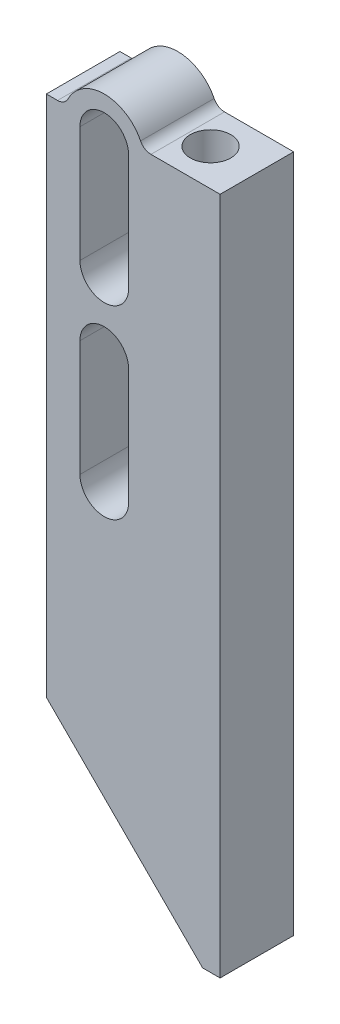
ISO-10303-21;
HEADER;
FILE_DESCRIPTION(('STEP AP214'),'2;1');
FILE_NAME('part.step','',(''),(''),'','','');
FILE_SCHEMA(('AUTOMOTIVE_DESIGN { 1 0 10303 214 1 1 1 1 }'));
ENDSEC;
DATA;
#1=APPLICATION_CONTEXT('core data for automotive mechanical design processes');
#2=APPLICATION_PROTOCOL_DEFINITION('international standard','automotive_design',2000,#1);
#3=PRODUCT_CONTEXT('',#1,'mechanical');
#4=PRODUCT('Part','Part','',(#3));
#5=PRODUCT_RELATED_PRODUCT_CATEGORY('part','',(#4));
#6=PRODUCT_DEFINITION_FORMATION('','',#4);
#7=PRODUCT_DEFINITION_CONTEXT('part definition',#1,'design');
#8=PRODUCT_DEFINITION('design','',#6,#7);
#9=PRODUCT_DEFINITION_SHAPE('','',#8);
#10=(LENGTH_UNIT() NAMED_UNIT(*) SI_UNIT(.MILLI.,.METRE.));
#11=(NAMED_UNIT(*) PLANE_ANGLE_UNIT() SI_UNIT($,.RADIAN.));
#12=(NAMED_UNIT(*) SI_UNIT($,.STERADIAN.) SOLID_ANGLE_UNIT());
#13=UNCERTAINTY_MEASURE_WITH_UNIT(LENGTH_MEASURE(1.E-05),#10,'distance_accuracy_value','');
#14=(GEOMETRIC_REPRESENTATION_CONTEXT(3) GLOBAL_UNCERTAINTY_ASSIGNED_CONTEXT((#13)) GLOBAL_UNIT_ASSIGNED_CONTEXT((#10,
#11,#12)) REPRESENTATION_CONTEXT('',''));
#15=CARTESIAN_POINT('',(0.,0.,0.));
#16=DIRECTION('',(0.,0.,1.));
#17=DIRECTION('',(1.,0.,0.));
#18=AXIS2_PLACEMENT_3D('',#15,#16,#17);
#19=CARTESIAN_POINT('',(137.825,40.4,-3.175));
#20=DIRECTION('',(0.,-1.,0.));
#21=DIRECTION('',(0.,0.,-1.));
#22=AXIS2_PLACEMENT_3D('',#19,#20,#21);
#23=PLANE('',#22);
#24=DIRECTION('',(0.,0.,1.));
#25=VECTOR('',#24,1.);
#26=CARTESIAN_POINT('',(137.825,40.4,-3.175));
#27=LINE('',#26,#25);
#28=CARTESIAN_POINT('',(137.825,40.4,-3.175));
#29=VERTEX_POINT('',#28);
#30=CARTESIAN_POINT('',(137.825,40.4,3.175));
#31=VERTEX_POINT('',#30);
#32=EDGE_CURVE('E265',#29,#31,#27,.T.);
#33=ORIENTED_EDGE('',*,*,#32,.T.);
#34=DIRECTION('',(1.,0.,0.));
#35=VECTOR('',#34,1.);
#36=CARTESIAN_POINT('',(137.825,40.4,3.175));
#37=LINE('',#36,#35);
#38=CARTESIAN_POINT('',(136.313708498985,40.4,3.175));
#39=VERTEX_POINT('',#38);
#40=EDGE_CURVE('E220',#39,#31,#37,.T.);
#41=ORIENTED_EDGE('',*,*,#40,.F.);
#42=DIRECTION('',(0.,0.,1.));
#43=VECTOR('',#42,1.);
#44=CARTESIAN_POINT('',(136.313708498985,40.4,-3.175));
#45=LINE('',#44,#43);
#46=CARTESIAN_POINT('',(136.313708498985,40.4,-3.175));
#47=VERTEX_POINT('',#46);
#48=EDGE_CURVE('E266',#47,#39,#45,.T.);
#49=ORIENTED_EDGE('',*,*,#48,.F.);
#50=DIRECTION('',(1.,0.,0.));
#51=VECTOR('',#50,1.);
#52=CARTESIAN_POINT('',(137.825,40.4,-3.175));
#53=LINE('',#52,#51);
#54=EDGE_CURVE('E245',#47,#29,#53,.T.);
#55=ORIENTED_EDGE('',*,*,#54,.T.);
#56=EDGE_LOOP('',(#33,#41,#49,#55));
#57=FACE_BOUND('',#56,.T.);
#58=ADVANCED_FACE('F31',(#57),#23,.T.);
#59=CARTESIAN_POINT('',(136.313708498985,40.4,-3.175));
#60=DIRECTION('',(-0.707106781186547,-0.707106781186548,0.));
#61=DIRECTION('',(0.707106781186548,-0.707106781186547,0.));
#62=AXIS2_PLACEMENT_3D('',#59,#60,#61);
#63=PLANE('',#62);
#64=ORIENTED_EDGE('',*,*,#48,.T.);
#65=DIRECTION('',(0.707106781186548,-0.707106781186547,0.));
#66=VECTOR('',#65,1.);
#67=CARTESIAN_POINT('',(136.313708498985,40.4,3.175));
#68=LINE('',#67,#66);
#69=CARTESIAN_POINT('',(122.825,53.888708498985,3.175));
#70=VERTEX_POINT('',#69);
#71=EDGE_CURVE('E242',#70,#39,#68,.T.);
#72=ORIENTED_EDGE('',*,*,#71,.F.);
#73=DIRECTION('',(0.,0.,1.));
#74=VECTOR('',#73,1.);
#75=CARTESIAN_POINT('',(122.825,53.888708498985,-3.175));
#76=LINE('',#75,#74);
#77=CARTESIAN_POINT('',(122.825,53.888708498985,-3.175));
#78=VERTEX_POINT('',#77);
#79=EDGE_CURVE('E269',#78,#70,#76,.T.);
#80=ORIENTED_EDGE('',*,*,#79,.F.);
#81=DIRECTION('',(0.707106781186548,-0.707106781186547,0.));
#82=VECTOR('',#81,1.);
#83=CARTESIAN_POINT('',(136.313708498985,40.4,-3.175));
#84=LINE('',#83,#82);
#85=EDGE_CURVE('E262',#78,#47,#84,.T.);
#86=ORIENTED_EDGE('',*,*,#85,.T.);
#87=EDGE_LOOP('',(#64,#72,#80,#86));
#88=FACE_BOUND('',#87,.T.);
#89=ADVANCED_FACE('F322',(#88),#63,.T.);
#90=CARTESIAN_POINT('',(122.825,53.888708498985,-3.175));
#91=DIRECTION('',(-1.,0.,0.));
#92=DIRECTION('',(0.,0.,1.));
#93=AXIS2_PLACEMENT_3D('',#90,#91,#92);
#94=PLANE('',#93);
#95=ORIENTED_EDGE('',*,*,#79,.T.);
#96=DIRECTION('',(0.,-1.,0.));
#97=VECTOR('',#96,1.);
#98=CARTESIAN_POINT('',(122.825,53.888708498985,3.175));
#99=LINE('',#98,#97);
#100=CARTESIAN_POINT('',(122.825,99.,3.175));
#101=VERTEX_POINT('',#100);
#102=EDGE_CURVE('E239',#101,#70,#99,.T.);
#103=ORIENTED_EDGE('',*,*,#102,.F.);
#104=DIRECTION('',(0.,0.,1.));
#105=VECTOR('',#104,1.);
#106=CARTESIAN_POINT('',(122.825,99.,-3.175));
#107=LINE('',#106,#105);
#108=CARTESIAN_POINT('',(122.825,99.,-3.175));
#109=VERTEX_POINT('',#108);
#110=EDGE_CURVE('E271',#109,#101,#107,.T.);
#111=ORIENTED_EDGE('',*,*,#110,.F.);
#112=DIRECTION('',(0.,-1.,0.));
#113=VECTOR('',#112,1.);
#114=CARTESIAN_POINT('',(122.825,53.888708498985,-3.175));
#115=LINE('',#114,#113);
#116=EDGE_CURVE('E259',#109,#78,#115,.T.);
#117=ORIENTED_EDGE('',*,*,#116,.T.);
#118=EDGE_LOOP('',(#95,#103,#111,#117));
#119=FACE_BOUND('',#118,.T.);
#120=ADVANCED_FACE('F318',(#119),#94,.T.);
#121=CARTESIAN_POINT('',(122.825,99.,-3.175));
#122=DIRECTION('',(0.,1.,0.));
#123=DIRECTION('',(0.,0.,1.));
#124=AXIS2_PLACEMENT_3D('',#121,#122,#123);
#125=PLANE('',#124);
#126=DIRECTION('',(-1.,0.,0.));
#127=VECTOR('',#126,1.);
#128=CARTESIAN_POINT('',(122.825,99.,3.175));
#129=LINE('',#128,#127);
#130=CARTESIAN_POINT('',(123.793871125851,99.,3.175));
#131=VERTEX_POINT('',#130);
#132=EDGE_CURVE('E237',#131,#101,#129,.T.);
#133=ORIENTED_EDGE('',*,*,#132,.F.);
#134=DIRECTION('',(0.,0.,-1.));
#135=VECTOR('',#134,1.);
#136=CARTESIAN_POINT('',(123.793871125851,99.,-3.175));
#137=LINE('',#136,#135);
#138=CARTESIAN_POINT('',(123.793871125851,99.,-3.175));
#139=VERTEX_POINT('',#138);
#140=EDGE_CURVE('E46',#131,#139,#137,.T.);
#141=ORIENTED_EDGE('',*,*,#140,.T.);
#142=DIRECTION('',(-1.,0.,0.));
#143=VECTOR('',#142,1.);
#144=CARTESIAN_POINT('',(122.825,99.,-3.175));
#145=LINE('',#144,#143);
#146=EDGE_CURVE('E257',#139,#109,#145,.T.);
#147=ORIENTED_EDGE('',*,*,#146,.T.);
#148=ORIENTED_EDGE('',*,*,#110,.T.);
#149=EDGE_LOOP('',(#133,#141,#147,#148));
#150=FACE_BOUND('',#149,.T.);
#151=ADVANCED_FACE('F315',(#150),#125,.T.);
#152=CARTESIAN_POINT('',(127.825,98.,-3.175));
#153=DIRECTION('',(0.,0.,1.));
#154=DIRECTION('',(1.,0.,0.));
#155=AXIS2_PLACEMENT_3D('',#152,#153,#154);
#156=CYLINDRICAL_SURFACE('',#155,3.5);
#157=CARTESIAN_POINT('',(127.825,98.,3.175));
#158=DIRECTION('',(0.,0.,1.));
#159=DIRECTION('',(1.,0.,0.));
#160=AXIS2_PLACEMENT_3D('',#157,#158,#159);
#161=CIRCLE('',#160,3.5);
#162=CARTESIAN_POINT('',(130.960322457672,99.5555555555555,3.175));
#163=VERTEX_POINT('',#162);
#164=CARTESIAN_POINT('',(124.689677542328,99.5555555555555,3.175));
#165=VERTEX_POINT('',#164);
#166=EDGE_CURVE('E235',#163,#165,#161,.T.);
#167=ORIENTED_EDGE('',*,*,#166,.F.);
#168=DIRECTION('',(0.,0.,1.));
#169=VECTOR('',#168,1.);
#170=CARTESIAN_POINT('',(130.960322457672,99.5555555555555,-3.175));
#171=LINE('',#170,#169);
#172=CARTESIAN_POINT('',(130.960322457672,99.5555555555555,-3.175));
#173=VERTEX_POINT('',#172);
#174=EDGE_CURVE('E286',#163,#173,#171,.F.);
#175=ORIENTED_EDGE('',*,*,#174,.T.);
#176=CARTESIAN_POINT('',(127.825,98.,-3.175));
#177=DIRECTION('',(0.,0.,1.));
#178=DIRECTION('',(1.,0.,0.));
#179=AXIS2_PLACEMENT_3D('',#176,#177,#178);
#180=CIRCLE('',#179,3.5);
#181=CARTESIAN_POINT('',(124.689677542328,99.5555555555555,-3.175));
#182=VERTEX_POINT('',#181);
#183=EDGE_CURVE('E254',#173,#182,#180,.T.);
#184=ORIENTED_EDGE('',*,*,#183,.T.);
#185=DIRECTION('',(0.,0.,1.));
#186=VECTOR('',#185,1.);
#187=CARTESIAN_POINT('',(124.689677542328,99.5555555555555,-3.175));
#188=LINE('',#187,#186);
#189=EDGE_CURVE('E283',#182,#165,#188,.T.);
#190=ORIENTED_EDGE('',*,*,#189,.T.);
#191=EDGE_LOOP('',(#167,#175,#184,#190));
#192=FACE_BOUND('',#191,.T.);
#193=ADVANCED_FACE('F308',(#192),#156,.T.);
#194=CARTESIAN_POINT('',(131.17910196625,99.,-3.175));
#195=DIRECTION('',(0.,1.,0.));
#196=DIRECTION('',(0.,0.,1.));
#197=AXIS2_PLACEMENT_3D('',#194,#195,#196);
#198=PLANE('',#197);
#199=CARTESIAN_POINT('',(133.825,99.,0.));
#200=DIRECTION('',(0.,1.,0.));
#201=DIRECTION('',(0.,0.,1.));
#202=AXIS2_PLACEMENT_3D('',#199,#200,#201);
#203=CIRCLE('',#202,1.75000000000001);
#204=CARTESIAN_POINT('',(133.825,99.,1.75000000000001));
#205=VERTEX_POINT('',#204);
#206=EDGE_CURVE('E537',#205,#205,#203,.T.);
#207=ORIENTED_EDGE('',*,*,#206,.F.);
#208=EDGE_LOOP('',(#207));
#209=FACE_BOUND('',#208,.T.);
#210=DIRECTION('',(-1.,0.,0.));
#211=VECTOR('',#210,1.);
#212=CARTESIAN_POINT('',(131.17910196625,99.,-3.175));
#213=LINE('',#212,#211);
#214=CARTESIAN_POINT('',(137.825,99.,-3.175));
#215=VERTEX_POINT('',#214);
#216=CARTESIAN_POINT('',(131.856128874149,99.,-3.175));
#217=VERTEX_POINT('',#216);
#218=EDGE_CURVE('E251',#215,#217,#213,.T.);
#219=ORIENTED_EDGE('',*,*,#218,.T.);
#220=DIRECTION('',(0.,0.,-1.));
#221=VECTOR('',#220,1.);
#222=CARTESIAN_POINT('',(131.856128874149,99.,3.175));
#223=LINE('',#222,#221);
#224=CARTESIAN_POINT('',(131.856128874149,99.,3.175));
#225=VERTEX_POINT('',#224);
#226=EDGE_CURVE('E268',#217,#225,#223,.F.);
#227=ORIENTED_EDGE('',*,*,#226,.T.);
#228=DIRECTION('',(-1.,0.,0.));
#229=VECTOR('',#228,1.);
#230=CARTESIAN_POINT('',(131.17910196625,99.,3.175));
#231=LINE('',#230,#229);
#232=CARTESIAN_POINT('',(137.825,99.,3.175));
#233=VERTEX_POINT('',#232);
#234=EDGE_CURVE('E232',#233,#225,#231,.T.);
#235=ORIENTED_EDGE('',*,*,#234,.F.);
#236=DIRECTION('',(0.,0.,1.));
#237=VECTOR('',#236,1.);
#238=CARTESIAN_POINT('',(137.825,99.,-3.175));
#239=LINE('',#238,#237);
#240=EDGE_CURVE('E274',#215,#233,#239,.T.);
#241=ORIENTED_EDGE('',*,*,#240,.F.);
#242=EDGE_LOOP('',(#219,#227,#235,#241));
#243=FACE_BOUND('',#242,.T.);
#244=ADVANCED_FACE('F302',(#209,#243),#198,.T.);
#245=CARTESIAN_POINT('',(137.825,99.,-3.175));
#246=DIRECTION('',(1.,0.,0.));
#247=DIRECTION('',(0.,1.,0.));
#248=AXIS2_PLACEMENT_3D('',#245,#246,#247);
#249=PLANE('',#248);
#250=ORIENTED_EDGE('',*,*,#240,.T.);
#251=DIRECTION('',(0.,1.,0.));
#252=VECTOR('',#251,1.);
#253=CARTESIAN_POINT('',(137.825,99.,3.175));
#254=LINE('',#253,#252);
#255=EDGE_CURVE('E229',#31,#233,#254,.T.);
#256=ORIENTED_EDGE('',*,*,#255,.F.);
#257=ORIENTED_EDGE('',*,*,#32,.F.);
#258=DIRECTION('',(0.,1.,0.));
#259=VECTOR('',#258,1.);
#260=CARTESIAN_POINT('',(137.825,99.,-3.175));
#261=LINE('',#260,#259);
#262=EDGE_CURVE('E248',#29,#215,#261,.T.);
#263=ORIENTED_EDGE('',*,*,#262,.T.);
#264=EDGE_LOOP('',(#250,#256,#257,#263));
#265=FACE_BOUND('',#264,.T.);
#266=ADVANCED_FACE('F325',(#265),#249,.T.);
#267=CARTESIAN_POINT('',(127.825,98.,-3.175));
#268=DIRECTION('',(0.,0.,1.));
#269=DIRECTION('',(1.,0.,0.));
#270=AXIS2_PLACEMENT_3D('',#267,#268,#269);
#271=PLANE('',#270);
#272=DIRECTION('',(0.,-1.,0.));
#273=VECTOR('',#272,1.);
#274=CARTESIAN_POINT('',(125.725,88.,-3.175));
#275=LINE('',#274,#273);
#276=CARTESIAN_POINT('',(125.725,98.,-3.175));
#277=VERTEX_POINT('',#276);
#278=CARTESIAN_POINT('',(125.725,88.,-3.175));
#279=VERTEX_POINT('',#278);
#280=EDGE_CURVE('E160',#277,#279,#275,.T.);
#281=ORIENTED_EDGE('',*,*,#280,.T.);
#282=CARTESIAN_POINT('',(127.825,88.,-3.175));
#283=DIRECTION('',(0.,0.,1.));
#284=DIRECTION('',(1.,0.,0.));
#285=AXIS2_PLACEMENT_3D('',#282,#283,#284);
#286=CIRCLE('',#285,2.09999999999999);
#287=CARTESIAN_POINT('',(129.925,88.,-3.175));
#288=VERTEX_POINT('',#287);
#289=EDGE_CURVE('E152',#279,#288,#286,.T.);
#290=ORIENTED_EDGE('',*,*,#289,.T.);
#291=DIRECTION('',(0.,1.,0.));
#292=VECTOR('',#291,1.);
#293=CARTESIAN_POINT('',(129.925,88.,-3.175));
#294=LINE('',#293,#292);
#295=CARTESIAN_POINT('',(129.925,98.,-3.175));
#296=VERTEX_POINT('',#295);
#297=EDGE_CURVE('E164',#288,#296,#294,.T.);
#298=ORIENTED_EDGE('',*,*,#297,.T.);
#299=CARTESIAN_POINT('',(127.825,98.,-3.175));
#300=DIRECTION('',(0.,0.,1.));
#301=DIRECTION('',(1.,0.,0.));
#302=AXIS2_PLACEMENT_3D('',#299,#300,#301);
#303=CIRCLE('',#302,2.09999999999996);
#304=EDGE_CURVE('E168',#296,#277,#303,.T.);
#305=ORIENTED_EDGE('',*,*,#304,.T.);
#306=EDGE_LOOP('',(#281,#290,#298,#305));
#307=FACE_BOUND('',#306,.T.);
#308=DIRECTION('',(0.,-1.,0.));
#309=VECTOR('',#308,1.);
#310=CARTESIAN_POINT('',(125.725,72.,-3.175));
#311=LINE('',#310,#309);
#312=CARTESIAN_POINT('',(125.725,82.,-3.175));
#313=VERTEX_POINT('',#312);
#314=CARTESIAN_POINT('',(125.725,72.,-3.175));
#315=VERTEX_POINT('',#314);
#316=EDGE_CURVE('E205',#313,#315,#311,.T.);
#317=ORIENTED_EDGE('',*,*,#316,.T.);
#318=CARTESIAN_POINT('',(127.825,72.,-3.175));
#319=DIRECTION('',(0.,0.,1.));
#320=DIRECTION('',(1.,0.,0.));
#321=AXIS2_PLACEMENT_3D('',#318,#319,#320);
#322=CIRCLE('',#321,2.09999999999999);
#323=CARTESIAN_POINT('',(129.925,72.,-3.175));
#324=VERTEX_POINT('',#323);
#325=EDGE_CURVE('E195',#315,#324,#322,.T.);
#326=ORIENTED_EDGE('',*,*,#325,.T.);
#327=DIRECTION('',(0.,1.,0.));
#328=VECTOR('',#327,1.);
#329=CARTESIAN_POINT('',(129.925,72.,-3.175));
#330=LINE('',#329,#328);
#331=CARTESIAN_POINT('',(129.925,82.,-3.175));
#332=VERTEX_POINT('',#331);
#333=EDGE_CURVE('E198',#324,#332,#330,.T.);
#334=ORIENTED_EDGE('',*,*,#333,.T.);
#335=CARTESIAN_POINT('',(127.825,82.,-3.175));
#336=DIRECTION('',(0.,0.,1.));
#337=DIRECTION('',(1.,0.,0.));
#338=AXIS2_PLACEMENT_3D('',#335,#336,#337);
#339=CIRCLE('',#338,2.09999999999999);
#340=EDGE_CURVE('E202',#332,#313,#339,.T.);
#341=ORIENTED_EDGE('',*,*,#340,.T.);
#342=EDGE_LOOP('',(#317,#326,#334,#341));
#343=FACE_BOUND('',#342,.T.);
#344=ORIENTED_EDGE('',*,*,#54,.F.);
#345=ORIENTED_EDGE('',*,*,#85,.F.);
#346=ORIENTED_EDGE('',*,*,#116,.F.);
#347=ORIENTED_EDGE('',*,*,#146,.F.);
#348=CARTESIAN_POINT('',(123.793871125851,100.,-3.175));
#349=DIRECTION('',(0.,0.,1.));
#350=DIRECTION('',(1.,0.,0.));
#351=AXIS2_PLACEMENT_3D('',#348,#349,#350);
#352=CIRCLE('',#351,1.);
#353=EDGE_CURVE('E11',#139,#182,#352,.T.);
#354=ORIENTED_EDGE('',*,*,#353,.T.);
#355=ORIENTED_EDGE('',*,*,#183,.F.);
#356=CARTESIAN_POINT('',(131.856128874149,100.,-3.175));
#357=DIRECTION('',(0.,0.,1.));
#358=DIRECTION('',(1.,0.,0.));
#359=AXIS2_PLACEMENT_3D('',#356,#357,#358);
#360=CIRCLE('',#359,1.);
#361=EDGE_CURVE('E291',#173,#217,#360,.T.);
#362=ORIENTED_EDGE('',*,*,#361,.T.);
#363=ORIENTED_EDGE('',*,*,#218,.F.);
#364=ORIENTED_EDGE('',*,*,#262,.F.);
#365=EDGE_LOOP('',(#344,#345,#346,#347,#354,#355,#362,#363,#364));
#366=FACE_BOUND('',#365,.T.);
#367=ADVANCED_FACE('F170',(#307,#343,#366),#271,.F.);
#368=CARTESIAN_POINT('',(127.825,98.,3.175));
#369=DIRECTION('',(0.,0.,1.));
#370=DIRECTION('',(1.,0.,0.));
#371=AXIS2_PLACEMENT_3D('',#368,#369,#370);
#372=PLANE('',#371);
#373=CARTESIAN_POINT('',(127.825,88.,3.175));
#374=DIRECTION('',(0.,0.,1.));
#375=DIRECTION('',(1.,0.,0.));
#376=AXIS2_PLACEMENT_3D('',#373,#374,#375);
#377=CIRCLE('',#376,2.09999999999999);
#378=CARTESIAN_POINT('',(125.725,88.,3.175));
#379=VERTEX_POINT('',#378);
#380=CARTESIAN_POINT('',(129.925,88.,3.175));
#381=VERTEX_POINT('',#380);
#382=EDGE_CURVE('E155',#379,#381,#377,.T.);
#383=ORIENTED_EDGE('',*,*,#382,.F.);
#384=DIRECTION('',(0.,-1.,0.));
#385=VECTOR('',#384,1.);
#386=CARTESIAN_POINT('',(125.725,88.,3.175));
#387=LINE('',#386,#385);
#388=CARTESIAN_POINT('',(125.725,98.,3.175));
#389=VERTEX_POINT('',#388);
#390=EDGE_CURVE('E173',#389,#379,#387,.T.);
#391=ORIENTED_EDGE('',*,*,#390,.F.);
#392=CARTESIAN_POINT('',(127.825,98.,3.175));
#393=DIRECTION('',(0.,0.,1.));
#394=DIRECTION('',(1.,0.,0.));
#395=AXIS2_PLACEMENT_3D('',#392,#393,#394);
#396=CIRCLE('',#395,2.09999999999996);
#397=CARTESIAN_POINT('',(129.925,98.,3.175));
#398=VERTEX_POINT('',#397);
#399=EDGE_CURVE('E176',#398,#389,#396,.T.);
#400=ORIENTED_EDGE('',*,*,#399,.F.);
#401=DIRECTION('',(0.,1.,0.));
#402=VECTOR('',#401,1.);
#403=CARTESIAN_POINT('',(129.925,88.,3.175));
#404=LINE('',#403,#402);
#405=EDGE_CURVE('E185',#381,#398,#404,.T.);
#406=ORIENTED_EDGE('',*,*,#405,.F.);
#407=EDGE_LOOP('',(#383,#391,#400,#406));
#408=FACE_BOUND('',#407,.T.);
#409=CARTESIAN_POINT('',(127.825,72.,3.175));
#410=DIRECTION('',(0.,0.,1.));
#411=DIRECTION('',(1.,0.,0.));
#412=AXIS2_PLACEMENT_3D('',#409,#410,#411);
#413=CIRCLE('',#412,2.09999999999999);
#414=CARTESIAN_POINT('',(125.725,72.,3.175));
#415=VERTEX_POINT('',#414);
#416=CARTESIAN_POINT('',(129.925,72.,3.175));
#417=VERTEX_POINT('',#416);
#418=EDGE_CURVE('E191',#415,#417,#413,.T.);
#419=ORIENTED_EDGE('',*,*,#418,.F.);
#420=DIRECTION('',(0.,-1.,0.));
#421=VECTOR('',#420,1.);
#422=CARTESIAN_POINT('',(125.725,72.,3.175));
#423=LINE('',#422,#421);
#424=CARTESIAN_POINT('',(125.725,82.,3.175));
#425=VERTEX_POINT('',#424);
#426=EDGE_CURVE('E199',#425,#415,#423,.T.);
#427=ORIENTED_EDGE('',*,*,#426,.F.);
#428=CARTESIAN_POINT('',(127.825,82.,3.175));
#429=DIRECTION('',(0.,0.,1.));
#430=DIRECTION('',(1.,0.,0.));
#431=AXIS2_PLACEMENT_3D('',#428,#429,#430);
#432=CIRCLE('',#431,2.09999999999999);
#433=CARTESIAN_POINT('',(129.925,82.,3.175));
#434=VERTEX_POINT('',#433);
#435=EDGE_CURVE('E213',#434,#425,#432,.T.);
#436=ORIENTED_EDGE('',*,*,#435,.F.);
#437=DIRECTION('',(0.,1.,0.));
#438=VECTOR('',#437,1.);
#439=CARTESIAN_POINT('',(129.925,72.,3.175));
#440=LINE('',#439,#438);
#441=EDGE_CURVE('E210',#417,#434,#440,.T.);
#442=ORIENTED_EDGE('',*,*,#441,.F.);
#443=EDGE_LOOP('',(#419,#427,#436,#442));
#444=FACE_BOUND('',#443,.T.);
#445=ORIENTED_EDGE('',*,*,#40,.T.);
#446=ORIENTED_EDGE('',*,*,#255,.T.);
#447=ORIENTED_EDGE('',*,*,#234,.T.);
#448=CARTESIAN_POINT('',(131.856128874149,100.,3.175));
#449=DIRECTION('',(0.,0.,1.));
#450=DIRECTION('',(1.,0.,0.));
#451=AXIS2_PLACEMENT_3D('',#448,#449,#450);
#452=CIRCLE('',#451,1.);
#453=EDGE_CURVE('E289',#225,#163,#452,.F.);
#454=ORIENTED_EDGE('',*,*,#453,.T.);
#455=ORIENTED_EDGE('',*,*,#166,.T.);
#456=CARTESIAN_POINT('',(123.793871125851,100.,3.175));
#457=DIRECTION('',(0.,0.,1.));
#458=DIRECTION('',(1.,0.,0.));
#459=AXIS2_PLACEMENT_3D('',#456,#457,#458);
#460=CIRCLE('',#459,1.);
#461=EDGE_CURVE('E39',#165,#131,#460,.F.);
#462=ORIENTED_EDGE('',*,*,#461,.T.);
#463=ORIENTED_EDGE('',*,*,#132,.T.);
#464=ORIENTED_EDGE('',*,*,#102,.T.);
#465=ORIENTED_EDGE('',*,*,#71,.T.);
#466=EDGE_LOOP('',(#445,#446,#447,#454,#455,#462,#463,#464,#465));
#467=FACE_BOUND('',#466,.T.);
#468=ADVANCED_FACE('F306',(#408,#444,#467),#372,.T.);
#469=CARTESIAN_POINT('',(127.825,72.,-3.175));
#470=DIRECTION('',(0.,0.,1.));
#471=DIRECTION('',(1.,0.,0.));
#472=AXIS2_PLACEMENT_3D('',#469,#470,#471);
#473=CYLINDRICAL_SURFACE('',#472,2.09999999999999);
#474=ORIENTED_EDGE('',*,*,#418,.T.);
#475=DIRECTION('',(0.,0.,1.));
#476=VECTOR('',#475,1.);
#477=CARTESIAN_POINT('',(129.925,72.,-3.175));
#478=LINE('',#477,#476);
#479=EDGE_CURVE('E208',#324,#417,#478,.T.);
#480=ORIENTED_EDGE('',*,*,#479,.F.);
#481=ORIENTED_EDGE('',*,*,#325,.F.);
#482=DIRECTION('',(0.,0.,1.));
#483=VECTOR('',#482,1.);
#484=CARTESIAN_POINT('',(125.725,72.,-3.175));
#485=LINE('',#484,#483);
#486=EDGE_CURVE('E218',#315,#415,#485,.T.);
#487=ORIENTED_EDGE('',*,*,#486,.T.);
#488=EDGE_LOOP('',(#474,#480,#481,#487));
#489=FACE_BOUND('',#488,.T.);
#490=ADVANCED_FACE('F379',(#489),#473,.F.);
#491=CARTESIAN_POINT('',(125.725,72.,-3.175));
#492=DIRECTION('',(-1.,0.,0.));
#493=DIRECTION('',(0.,0.,1.));
#494=AXIS2_PLACEMENT_3D('',#491,#492,#493);
#495=PLANE('',#494);
#496=ORIENTED_EDGE('',*,*,#426,.T.);
#497=ORIENTED_EDGE('',*,*,#486,.F.);
#498=ORIENTED_EDGE('',*,*,#316,.F.);
#499=DIRECTION('',(0.,0.,1.));
#500=VECTOR('',#499,1.);
#501=CARTESIAN_POINT('',(125.725,82.,-3.175));
#502=LINE('',#501,#500);
#503=EDGE_CURVE('E221',#313,#425,#502,.T.);
#504=ORIENTED_EDGE('',*,*,#503,.T.);
#505=EDGE_LOOP('',(#496,#497,#498,#504));
#506=FACE_BOUND('',#505,.T.);
#507=ADVANCED_FACE('F375',(#506),#495,.F.);
#508=CARTESIAN_POINT('',(127.825,82.,-3.175));
#509=DIRECTION('',(0.,0.,1.));
#510=DIRECTION('',(1.,0.,0.));
#511=AXIS2_PLACEMENT_3D('',#508,#509,#510);
#512=CYLINDRICAL_SURFACE('',#511,2.09999999999999);
#513=ORIENTED_EDGE('',*,*,#435,.T.);
#514=ORIENTED_EDGE('',*,*,#503,.F.);
#515=ORIENTED_EDGE('',*,*,#340,.F.);
#516=DIRECTION('',(0.,0.,1.));
#517=VECTOR('',#516,1.);
#518=CARTESIAN_POINT('',(129.925,82.,-3.175));
#519=LINE('',#518,#517);
#520=EDGE_CURVE('E223',#332,#434,#519,.T.);
#521=ORIENTED_EDGE('',*,*,#520,.T.);
#522=EDGE_LOOP('',(#513,#514,#515,#521));
#523=FACE_BOUND('',#522,.T.);
#524=ADVANCED_FACE('F378',(#523),#512,.F.);
#525=CARTESIAN_POINT('',(129.925,72.,-3.175));
#526=DIRECTION('',(1.,0.,0.));
#527=DIRECTION('',(0.,0.,-1.));
#528=AXIS2_PLACEMENT_3D('',#525,#526,#527);
#529=PLANE('',#528);
#530=ORIENTED_EDGE('',*,*,#441,.T.);
#531=ORIENTED_EDGE('',*,*,#520,.F.);
#532=ORIENTED_EDGE('',*,*,#333,.F.);
#533=ORIENTED_EDGE('',*,*,#479,.T.);
#534=EDGE_LOOP('',(#530,#531,#532,#533));
#535=FACE_BOUND('',#534,.T.);
#536=ADVANCED_FACE('F374',(#535),#529,.F.);
#537=CARTESIAN_POINT('',(127.825,88.,-3.175));
#538=DIRECTION('',(0.,0.,1.));
#539=DIRECTION('',(1.,0.,0.));
#540=AXIS2_PLACEMENT_3D('',#537,#538,#539);
#541=CYLINDRICAL_SURFACE('',#540,2.09999999999999);
#542=ORIENTED_EDGE('',*,*,#382,.T.);
#543=DIRECTION('',(0.,0.,1.));
#544=VECTOR('',#543,1.);
#545=CARTESIAN_POINT('',(129.925,88.,-3.175));
#546=LINE('',#545,#544);
#547=EDGE_CURVE('E148',#288,#381,#546,.T.);
#548=ORIENTED_EDGE('',*,*,#547,.F.);
#549=ORIENTED_EDGE('',*,*,#289,.F.);
#550=DIRECTION('',(0.,0.,1.));
#551=VECTOR('',#550,1.);
#552=CARTESIAN_POINT('',(125.725,88.,-3.175));
#553=LINE('',#552,#551);
#554=EDGE_CURVE('E189',#279,#379,#553,.T.);
#555=ORIENTED_EDGE('',*,*,#554,.T.);
#556=EDGE_LOOP('',(#542,#548,#549,#555));
#557=FACE_BOUND('',#556,.T.);
#558=ADVANCED_FACE('F150',(#557),#541,.F.);
#559=CARTESIAN_POINT('',(125.725,88.,-3.175));
#560=DIRECTION('',(-1.,0.,0.));
#561=DIRECTION('',(0.,-1.,0.));
#562=AXIS2_PLACEMENT_3D('',#559,#560,#561);
#563=PLANE('',#562);
#564=ORIENTED_EDGE('',*,*,#390,.T.);
#565=ORIENTED_EDGE('',*,*,#554,.F.);
#566=ORIENTED_EDGE('',*,*,#280,.F.);
#567=DIRECTION('',(0.,0.,1.));
#568=VECTOR('',#567,1.);
#569=CARTESIAN_POINT('',(125.725,98.,-3.175));
#570=LINE('',#569,#568);
#571=EDGE_CURVE('E192',#277,#389,#570,.T.);
#572=ORIENTED_EDGE('',*,*,#571,.T.);
#573=EDGE_LOOP('',(#564,#565,#566,#572));
#574=FACE_BOUND('',#573,.T.);
#575=ADVANCED_FACE('F361',(#574),#563,.F.);
#576=CARTESIAN_POINT('',(127.825,98.,-3.175));
#577=DIRECTION('',(0.,0.,1.));
#578=DIRECTION('',(1.,0.,0.));
#579=AXIS2_PLACEMENT_3D('',#576,#577,#578);
#580=CYLINDRICAL_SURFACE('',#579,2.09999999999996);
#581=ORIENTED_EDGE('',*,*,#399,.T.);
#582=ORIENTED_EDGE('',*,*,#571,.F.);
#583=ORIENTED_EDGE('',*,*,#304,.F.);
#584=DIRECTION('',(0.,0.,1.));
#585=VECTOR('',#584,1.);
#586=CARTESIAN_POINT('',(129.925,98.,-3.175));
#587=LINE('',#586,#585);
#588=EDGE_CURVE('E159',#296,#398,#587,.T.);
#589=ORIENTED_EDGE('',*,*,#588,.T.);
#590=EDGE_LOOP('',(#581,#582,#583,#589));
#591=FACE_BOUND('',#590,.T.);
#592=ADVANCED_FACE('F364',(#591),#580,.F.);
#593=CARTESIAN_POINT('',(129.925,88.,-3.175));
#594=DIRECTION('',(1.,0.,0.));
#595=DIRECTION('',(0.,1.,0.));
#596=AXIS2_PLACEMENT_3D('',#593,#594,#595);
#597=PLANE('',#596);
#598=ORIENTED_EDGE('',*,*,#405,.T.);
#599=ORIENTED_EDGE('',*,*,#588,.F.);
#600=ORIENTED_EDGE('',*,*,#297,.F.);
#601=ORIENTED_EDGE('',*,*,#547,.T.);
#602=EDGE_LOOP('',(#598,#599,#600,#601));
#603=FACE_BOUND('',#602,.T.);
#604=ADVANCED_FACE('F165',(#603),#597,.F.);
#605=CARTESIAN_POINT('',(133.825,94.,0.));
#606=DIRECTION('',(0.,1.,0.));
#607=DIRECTION('',(0.,0.,1.));
#608=AXIS2_PLACEMENT_3D('',#605,#606,#607);
#609=PLANE('',#608);
#610=CARTESIAN_POINT('',(133.825,94.,0.));
#611=DIRECTION('',(0.,1.,0.));
#612=DIRECTION('',(0.,0.,1.));
#613=AXIS2_PLACEMENT_3D('',#610,#611,#612);
#614=CIRCLE('',#613,1.75000000000001);
#615=CARTESIAN_POINT('',(133.825,94.,1.75000000000001));
#616=VERTEX_POINT('',#615);
#617=EDGE_CURVE('E280',#616,#616,#614,.T.);
#618=ORIENTED_EDGE('',*,*,#617,.T.);
#619=EDGE_LOOP('',(#618));
#620=FACE_BOUND('',#619,.T.);
#621=CARTESIAN_POINT('',(133.825,94.,0.));
#622=DIRECTION('',(0.,1.,0.));
#623=DIRECTION('',(0.,0.,1.));
#624=AXIS2_PLACEMENT_3D('',#621,#622,#623);
#625=CIRCLE('',#624,1.5);
#626=CARTESIAN_POINT('',(133.825,94.,1.5));
#627=VERTEX_POINT('',#626);
#628=EDGE_CURVE('E277',#627,#627,#625,.F.);
#629=ORIENTED_EDGE('',*,*,#628,.T.);
#630=EDGE_LOOP('',(#629));
#631=FACE_BOUND('',#630,.T.);
#632=ADVANCED_FACE('F371',(#620,#631),#609,.T.);
#633=CARTESIAN_POINT('',(133.825,94.,0.));
#634=DIRECTION('',(0.,1.,0.));
#635=DIRECTION('',(0.,0.,1.));
#636=AXIS2_PLACEMENT_3D('',#633,#634,#635);
#637=CYLINDRICAL_SURFACE('',#636,1.75000000000001);
#638=ORIENTED_EDGE('',*,*,#617,.F.);
#639=EDGE_LOOP('',(#638));
#640=FACE_BOUND('',#639,.T.);
#641=ORIENTED_EDGE('',*,*,#206,.T.);
#642=EDGE_LOOP('',(#641));
#643=FACE_BOUND('',#642,.T.);
#644=ADVANCED_FACE('F354',(#640,#643),#637,.F.);
#645=CARTESIAN_POINT('',(133.825,74.,0.));
#646=DIRECTION('',(0.,1.,0.));
#647=DIRECTION('',(0.,0.,1.));
#648=AXIS2_PLACEMENT_3D('',#645,#646,#647);
#649=PLANE('',#648);
#650=CARTESIAN_POINT('',(133.825,74.,0.));
#651=DIRECTION('',(0.,1.,0.));
#652=DIRECTION('',(0.,0.,1.));
#653=AXIS2_PLACEMENT_3D('',#650,#651,#652);
#654=CIRCLE('',#653,1.5);
#655=CARTESIAN_POINT('',(133.825,74.,1.5));
#656=VERTEX_POINT('',#655);
#657=EDGE_CURVE('E179',#656,#656,#654,.T.);
#658=ORIENTED_EDGE('',*,*,#657,.T.);
#659=EDGE_LOOP('',(#658));
#660=FACE_BOUND('',#659,.T.);
#661=ADVANCED_FACE('F348',(#660),#649,.T.);
#662=CARTESIAN_POINT('',(133.825,74.,0.));
#663=DIRECTION('',(0.,1.,0.));
#664=DIRECTION('',(0.,0.,1.));
#665=AXIS2_PLACEMENT_3D('',#662,#663,#664);
#666=CYLINDRICAL_SURFACE('',#665,1.5);
#667=ORIENTED_EDGE('',*,*,#657,.F.);
#668=EDGE_LOOP('',(#667));
#669=FACE_BOUND('',#668,.T.);
#670=ORIENTED_EDGE('',*,*,#628,.F.);
#671=EDGE_LOOP('',(#670));
#672=FACE_BOUND('',#671,.T.);
#673=ADVANCED_FACE('F343',(#669,#672),#666,.F.);
#674=CARTESIAN_POINT('',(131.856128874149,100.,-3.175));
#675=DIRECTION('',(0.,0.,1.));
#676=DIRECTION('',(1.,0.,0.));
#677=AXIS2_PLACEMENT_3D('',#674,#675,#676);
#678=CYLINDRICAL_SURFACE('',#677,1.);
#679=ORIENTED_EDGE('',*,*,#361,.F.);
#680=ORIENTED_EDGE('',*,*,#174,.F.);
#681=ORIENTED_EDGE('',*,*,#453,.F.);
#682=ORIENTED_EDGE('',*,*,#226,.F.);
#683=EDGE_LOOP('',(#679,#680,#681,#682));
#684=FACE_BOUND('',#683,.T.);
#685=ADVANCED_FACE('F304',(#684),#678,.F.);
#686=CARTESIAN_POINT('',(123.793871125851,100.,-3.175));
#687=DIRECTION('',(0.,0.,1.));
#688=DIRECTION('',(1.,0.,0.));
#689=AXIS2_PLACEMENT_3D('',#686,#687,#688);
#690=CYLINDRICAL_SURFACE('',#689,1.);
#691=ORIENTED_EDGE('',*,*,#353,.F.);
#692=ORIENTED_EDGE('',*,*,#140,.F.);
#693=ORIENTED_EDGE('',*,*,#461,.F.);
#694=ORIENTED_EDGE('',*,*,#189,.F.);
#695=EDGE_LOOP('',(#691,#692,#693,#694));
#696=FACE_BOUND('',#695,.T.);
#697=ADVANCED_FACE('F33',(#696),#690,.F.);
#698=CLOSED_SHELL('',(#58,#89,#120,#151,#193,#244,#266,#367,#468,#490,#507,#524,#536,#558,#575,
#592,#604,#632,#644,#661,#673,#685,#697));
#699=MANIFOLD_SOLID_BREP('B2',#698);
#700=ADVANCED_BREP_SHAPE_REPRESENTATION('',(#18,#699),#14);
#701=SHAPE_DEFINITION_REPRESENTATION(#9,#700);
ENDSEC;
END-ISO-10303-21;
